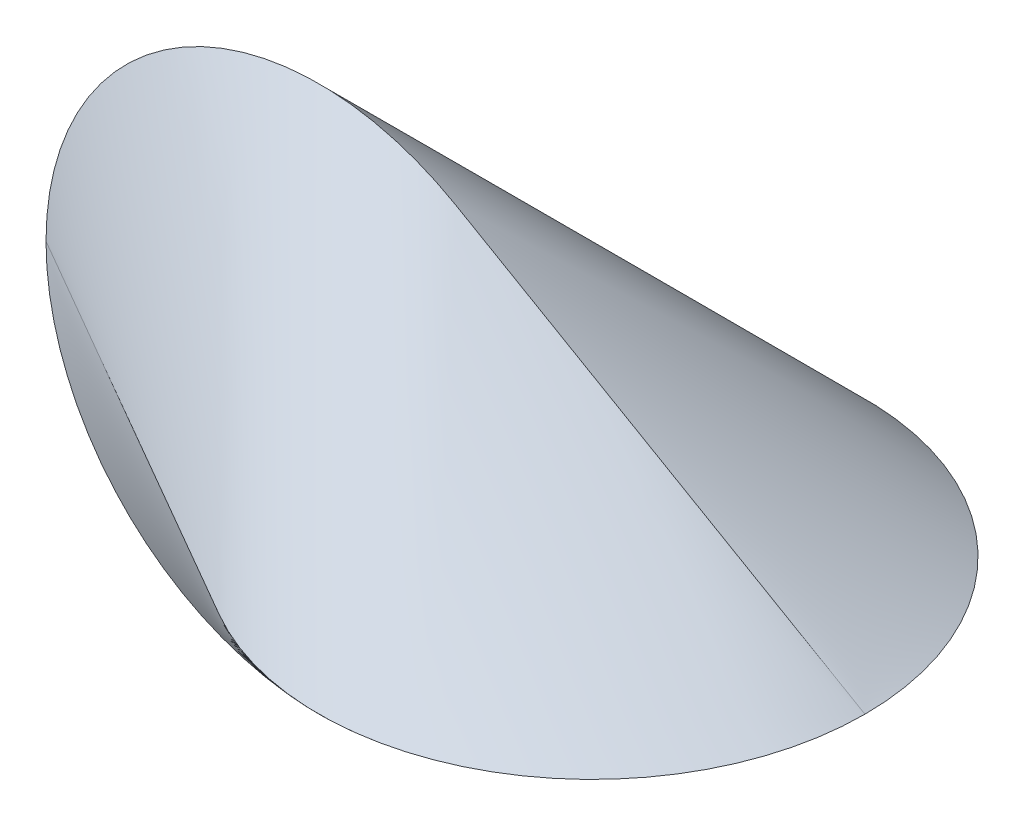
ISO-10303-21;
HEADER;
FILE_DESCRIPTION(('STEP AP214'),'2;1');
FILE_NAME('part.step','',(''),(''),'','','');
FILE_SCHEMA(('AUTOMOTIVE_DESIGN { 1 0 10303 214 1 1 1 1 }'));
ENDSEC;
DATA;
#1=APPLICATION_CONTEXT('core data for automotive mechanical design processes');
#2=APPLICATION_PROTOCOL_DEFINITION('international standard','automotive_design',2000,#1);
#3=PRODUCT_CONTEXT('',#1,'mechanical');
#4=PRODUCT('Part','Part','',(#3));
#5=PRODUCT_RELATED_PRODUCT_CATEGORY('part','',(#4));
#6=PRODUCT_DEFINITION_FORMATION('','',#4);
#7=PRODUCT_DEFINITION_CONTEXT('part definition',#1,'design');
#8=PRODUCT_DEFINITION('design','',#6,#7);
#9=PRODUCT_DEFINITION_SHAPE('','',#8);
#10=(LENGTH_UNIT() NAMED_UNIT(*) SI_UNIT(.MILLI.,.METRE.));
#11=(NAMED_UNIT(*) PLANE_ANGLE_UNIT() SI_UNIT($,.RADIAN.));
#12=(NAMED_UNIT(*) SI_UNIT($,.STERADIAN.) SOLID_ANGLE_UNIT());
#13=UNCERTAINTY_MEASURE_WITH_UNIT(LENGTH_MEASURE(1.E-05),#10,'distance_accuracy_value','');
#14=(GEOMETRIC_REPRESENTATION_CONTEXT(3) GLOBAL_UNCERTAINTY_ASSIGNED_CONTEXT((#13)) GLOBAL_UNIT_ASSIGNED_CONTEXT((#10,
#11,#12)) REPRESENTATION_CONTEXT('',''));
#15=CARTESIAN_POINT('',(0.,0.,0.));
#16=DIRECTION('',(0.,0.,1.));
#17=DIRECTION('',(1.,0.,0.));
#18=AXIS2_PLACEMENT_3D('',#15,#16,#17);
#19=CARTESIAN_POINT('',(-30.,0.,0.));
#20=CARTESIAN_POINT('',(-30.,0.,0.));
#21=CARTESIAN_POINT('',(-30.,0.,0.));
#22=CARTESIAN_POINT('',(-30.,0.,0.));
#23=CARTESIAN_POINT('',(-29.999999999999,2.02652571655713,0.));
#24=CARTESIAN_POINT('',(-29.1721405158975,1.36888850937507,0.441861216769966));
#25=CARTESIAN_POINT('',(-28.3370911941267,0.657637207182057,0.996184525936));
#26=CARTESIAN_POINT('',(-27.5092317100252,0.,1.43804574270596));
#27=CARTESIAN_POINT('',(-29.3758639581776,6.12661922809702,0.));
#28=CARTESIAN_POINT('',(-27.1481369070821,4.12004069335033,1.31693344307382));
#29=CARTESIAN_POINT('',(-24.8738394638612,2.00657853474668,2.92883553500629));
#30=CARTESIAN_POINT('',(-22.6461124127657,0.,4.24576897808011));
#31=CARTESIAN_POINT('',(-26.5968700151901,11.7186409793918,0.));
#32=CARTESIAN_POINT('',(-22.9242571474331,7.84403945583706,2.66235308980849));
#33=CARTESIAN_POINT('',(-19.1017200557311,3.87460152355479,5.750155797548));
#34=CARTESIAN_POINT('',(-15.4291071879742,0.,8.41250888735649));
#35=CARTESIAN_POINT('',(-22.3258043594985,16.1307065611163,0.));
#36=CARTESIAN_POINT('',(-17.6425701360325,10.7714781909292,4.09373168304798));
#37=CARTESIAN_POINT('',(-12.7219524219967,5.35922837018708,8.58562027677983));
#38=CARTESIAN_POINT('',(-8.03871819853068,0.,12.6793519598278));
#39=CARTESIAN_POINT('',(-18.8594471651255,18.0322155544078,0.));
#40=CARTESIAN_POINT('',(-13.58074727781,12.0316846066805,5.14770130434456));
#41=CARTESIAN_POINT('',(-8.07456166279271,6.00053094772732,10.5586152226558));
#42=CARTESIAN_POINT('',(-2.79586177547721,0.,15.7063165270003));
#43=CARTESIAN_POINT('',(-16.5347700384664,18.9110267337887,0.));
#44=CARTESIAN_POINT('',(-10.8006998133006,12.6139539091773,5.89187484329007));
#45=CARTESIAN_POINT('',(-4.89327516469523,6.29707282461142,11.914066486895));
#46=CARTESIAN_POINT('',(0.840795060470524,0.,17.805941330185));
#47=CARTESIAN_POINT('',(-15.4488115595125,19.2688613955564,0.));
#48=CARTESIAN_POINT('',(-9.46703703163746,12.8509762527413,6.19845261707458));
#49=CARTESIAN_POINT('',(-3.35111727803137,6.41788514281512,12.471956435553));
#50=CARTESIAN_POINT('',(2.63065724984368,0.,18.6704090526276));
#51=CARTESIAN_POINT('',(-14.0431163262214,19.6025487322914,0.));
#52=CARTESIAN_POINT('',(-7.75802680131317,13.0715916771179,6.44642954609055));
#53=CARTESIAN_POINT('',(-1.39620492865268,6.5309570551735,12.9255896159746));
#54=CARTESIAN_POINT('',(4.88888459625551,0.,19.3720191620651));
#55=CARTESIAN_POINT('',(-12.8704816961395,19.7997706767226,0.));
#56=CARTESIAN_POINT('',(-6.39679917756264,13.2016957708132,6.56902245409899));
#57=CARTESIAN_POINT('',(0.116354496553841,6.5980749059094,13.1515142631407));
#58=CARTESIAN_POINT('',(6.59003701513068,0.,19.7205367172397));
#59=CARTESIAN_POINT('',(-11.9606180996659,19.911038079795,0.));
#60=CARTESIAN_POINT('',(-5.37857907199369,13.2749491594257,6.62839185019588));
#61=CARTESIAN_POINT('',(1.22097215419215,6.63608892036928,13.2616542200353));
#62=CARTESIAN_POINT('',(7.80301118186434,0.,19.8900460702312));
#63=CARTESIAN_POINT('',(-11.0111121639683,19.9821773534449,0.));
#64=CARTESIAN_POINT('',(-4.36093060531631,13.3216744527373,6.66050290070785));
#65=CARTESIAN_POINT('',(2.29273451612758,6.66050290070756,13.3216744527378));
#66=CARTESIAN_POINT('',(8.94291607477959,0.,19.9821773534456));
#67=CARTESIAN_POINT('',(-10.0114929403231,20.0089113232772,0.));
#68=CARTESIAN_POINT('',(-3.33658371964466,13.3391627736311,6.66974854964606));
#69=CARTESIAN_POINT('',(3.33658371963663,6.66974854964606,13.3391627736311));
#70=CARTESIAN_POINT('',(10.0114929403151,0.,20.0089113232771));
#71=CARTESIAN_POINT('',(-8.942916074788,19.9821773534465,0.));
#72=CARTESIAN_POINT('',(-2.29273451613462,13.3216744527384,6.66050290070783));
#73=CARTESIAN_POINT('',(4.36093060531026,6.66050290070817,13.3216744527378));
#74=CARTESIAN_POINT('',(11.0111121639636,0.,19.9821773534456));
#75=CARTESIAN_POINT('',(-7.80301118186965,19.8900460702327,0.));
#76=CARTESIAN_POINT('',(-1.22097006300281,13.2616542200362,6.63609055258724));
#77=CARTESIAN_POINT('',(5.37858268405185,6.62839185019642,13.2749519787113));
#78=CARTESIAN_POINT('',(11.9606238029187,0.,19.9110425312985));
#79=CARTESIAN_POINT('',(-6.59003701513404,19.7205367172416,0.));
#80=CARTESIAN_POINT('',(-0.116358479631162,13.1515142631419,6.59807341558355));
#81=CARTESIAN_POINT('',(6.39679229770426,6.5690224540997,13.201693196614));
#82=CARTESIAN_POINT('',(12.8704708332071,0.,19.7997666121976));
#83=CARTESIAN_POINT('',(-4.88888459625611,19.3720191620674,0.));
#84=CARTESIAN_POINT('',(1.39620634696012,12.925589615976,6.53095814972875));
#85=CARTESIAN_POINT('',(7.75802925111737,6.44642954609137,13.0715935677133));
#86=CARTESIAN_POINT('',(14.0431201943336,0.,19.602551717442));
#87=CARTESIAN_POINT('',(-2.63065724984062,18.6704090526295,0.));
#88=CARTESIAN_POINT('',(3.35111573349997,12.4719564355542,6.41788467940547));
#89=CARTESIAN_POINT('',(9.46703436380828,6.19845261707526,12.8509754523064));
#90=CARTESIAN_POINT('',(15.4488073471489,0.,19.2688601317119));
#91=CARTESIAN_POINT('',(-0.840795060463497,17.8059413301851,0.));
#92=CARTESIAN_POINT('',(4.89327516470093,11.914066486895,6.29707282461188));
#93=CARTESIAN_POINT('',(10.8006998133054,5.8918748432901,12.6139539091781));
#94=CARTESIAN_POINT('',(16.5347700384698,0.,18.91102673379));
#95=CARTESIAN_POINT('',(2.79586177548442,15.7063165270001,0.));
#96=CARTESIAN_POINT('',(8.07456166279871,10.5586152226556,6.00053094772784));
#97=CARTESIAN_POINT('',(13.5807472778152,5.14770130434449,12.0316846066814));
#98=CARTESIAN_POINT('',(18.8594471651295,0.,18.0322155544092));
#99=CARTESIAN_POINT('',(8.03871819853689,12.6793519598278,0.));
#100=CARTESIAN_POINT('',(12.721952422002,8.58562027677985,5.35922837018771));
#101=CARTESIAN_POINT('',(17.6425701360372,4.09373168304798,10.7714781909303));
#102=CARTESIAN_POINT('',(22.3258043595024,0.,16.130706561118));
#103=CARTESIAN_POINT('',(15.4291071879789,8.41250888735648,0.));
#104=CARTESIAN_POINT('',(19.1017200557354,5.75015579754799,3.87460152355538));
#105=CARTESIAN_POINT('',(22.9242571474371,2.66235308980848,7.84403945583807));
#106=CARTESIAN_POINT('',(26.5968700151937,0.,11.7186409793935));
#107=CARTESIAN_POINT('',(22.6461124127683,4.24576897808012,0.));
#108=CARTESIAN_POINT('',(24.8738394638637,2.9288355350063,2.00657853474702));
#109=CARTESIAN_POINT('',(27.1481369070846,1.31693344307382,4.12004069335091));
#110=CARTESIAN_POINT('',(29.37586395818,0.,6.12661922809793));
#111=CARTESIAN_POINT('',(27.5092317100261,1.43804574270596,0.));
#112=CARTESIAN_POINT('',(28.3370911941276,0.996184525936,0.65763720718217));
#113=CARTESIAN_POINT('',(29.1721405158983,0.441861216769965,1.36888850937526));
#114=CARTESIAN_POINT('',(29.9999999999998,0.,2.02652571655743));
#115=CARTESIAN_POINT('',(29.9999999999999,0.,0.));
#116=CARTESIAN_POINT('',(29.9999999999999,0.,0.));
#117=CARTESIAN_POINT('',(29.9999999999999,0.,0.));
#118=CARTESIAN_POINT('',(29.9999999999999,0.,0.));
#119=B_SPLINE_SURFACE_WITH_KNOTS('',3,3,((#19,#20,#21,#22),(#23,#24,#25,#26),(#27,#28,#29,#30),
(#31,#32,#33,#34),(#35,#36,#37,#38),(#39,#40,#41,#42),(#43,#44,#45,#46),(#47,#48,#49,#50),(#51,
#52,#53,#54),(#55,#56,#57,#58),(#59,#60,#61,#62),(#63,#64,#65,#66),(#67,#68,#69,#70),(#71,#72,
#73,#74),(#75,#76,#77,#78),(#79,#80,#81,#82),(#83,#84,#85,#86),(#87,#88,#89,#90),(#91,#92,#93,
#94),(#95,#96,#97,#98),(#99,#100,#101,#102),(#103,#104,#105,#106),(#107,#108,#109,#110),(#111,
#112,#113,#114),(#115,#116,#117,#118)),.UNSPECIFIED.,.F.,.F.,.F.,(4,1,1,1,2,1,1,1,1,1,1,1,1,1,1,
1,2,1,1,1,4),(4,4),(0.,0.0961,0.1922,0.2883,0.3844,0.4133,0.4422,0.45665,0.4711,0.48555,0.5,
0.51445,0.5289,0.54335,0.5578,0.5867,0.6156,0.7117,0.8078,0.9039,1.),(0.,0.25),.UNSPECIFIED.);
#120=DIRECTION('',(0.866025403784439,0.,0.499999999999999));
#121=VECTOR('',#120,1.);
#122=CARTESIAN_POINT('',(-30.,0.,0.));
#123=LINE('',#122,#121);
#124=CARTESIAN_POINT('',(-30.,0.,0.));
#125=VERTEX_POINT('',#124);
#126=CARTESIAN_POINT('',(5.19652803747687E-11,0.,17.3205080757191));
#127=VERTEX_POINT('',#126);
#128=EDGE_CURVE('E13',#125,#127,#123,.T.);
#129=CARTESIAN_POINT('',(9.99999999999995,0.,0.));
#130=DIRECTION('',(0.,-1.,0.));
#131=DIRECTION('',(0.,0.,1.));
#132=AXIS2_PLACEMENT_3D('',#129,#130,#131);
#133=CIRCLE('',#132,19.9999999999999);
#134=CARTESIAN_POINT('',(29.9999999999999,0.,0.));
#135=VERTEX_POINT('',#134);
#136=EDGE_CURVE('E517',#127,#135,#133,.F.);
#137=DIRECTION('',(0.866025403784438,-0.500000000000001,0.));
#138=VECTOR('',#137,1.);
#139=CARTESIAN_POINT('',(29.9999999999999,0.,0.));
#140=LINE('',#139,#138);
#141=CARTESIAN_POINT('',(6.95043437422136E-12,17.3205080756892,0.));
#142=VERTEX_POINT('',#141);
#143=EDGE_CURVE('E525',#142,#135,#140,.T.);
#144=CARTESIAN_POINT('',(-10.,0.,0.));
#145=DIRECTION('',(0.,0.,-1.));
#146=DIRECTION('',(1.,0.,0.));
#147=AXIS2_PLACEMENT_3D('',#144,#145,#146);
#148=CIRCLE('',#147,20.);
#149=EDGE_CURVE('E545',#125,#142,#148,.T.);
#150=ORIENTED_EDGE('',*,*,#128,.T.);
#151=ORIENTED_EDGE('',*,*,#136,.T.);
#152=ORIENTED_EDGE('',*,*,#143,.F.);
#153=ORIENTED_EDGE('',*,*,#149,.F.);
#154=EDGE_LOOP('',(#150,#151,#152,#153));
#155=FACE_BOUND('',#154,.T.);
#156=ADVANCED_FACE('F504',(#155),#119,.F.);
#157=CARTESIAN_POINT('',(-30.,0.,0.));
#158=CARTESIAN_POINT('',(-30.,0.,0.));
#159=CARTESIAN_POINT('',(-30.,0.,0.));
#160=CARTESIAN_POINT('',(-30.,0.,0.));
#161=CARTESIAN_POINT('',(-27.5092317100252,0.,1.43804574270596));
#162=CARTESIAN_POINT('',(-28.3370911941267,-0.657637207182056,0.996184525936003));
#163=CARTESIAN_POINT('',(-29.1721405158975,-1.36888850937507,0.441861216769972));
#164=CARTESIAN_POINT('',(-29.999999999999,-2.02652571655713,0.));
#165=CARTESIAN_POINT('',(-22.6461124127657,0.,4.24576897808011));
#166=CARTESIAN_POINT('',(-24.8738394638611,-2.00657853474668,2.92883553500629));
#167=CARTESIAN_POINT('',(-27.1481369070821,-4.12004069335033,1.31693344307383));
#168=CARTESIAN_POINT('',(-29.3758639581776,-6.12661922809701,0.));
#169=CARTESIAN_POINT('',(-15.4291071879742,0.,8.41250888735649));
#170=CARTESIAN_POINT('',(-19.1017200557311,-3.87460152355479,5.750155797548));
#171=CARTESIAN_POINT('',(-22.9242571474331,-7.84403945583706,2.6623530898085));
#172=CARTESIAN_POINT('',(-26.5968700151901,-11.7186409793918,0.));
#173=CARTESIAN_POINT('',(-8.03871819853069,0.,12.6793519598278));
#174=CARTESIAN_POINT('',(-12.7219524219967,-5.35922837018708,8.58562027677984));
#175=CARTESIAN_POINT('',(-17.6425701360325,-10.7714781909292,4.09373168304799));
#176=CARTESIAN_POINT('',(-22.3258043594985,-16.1307065611163,0.));
#177=CARTESIAN_POINT('',(-2.79586177547721,0.,15.7063165270003));
#178=CARTESIAN_POINT('',(-8.0745616627927,-6.00053094772732,10.5586152226558));
#179=CARTESIAN_POINT('',(-13.58074727781,-12.0316846066805,5.14770130434457));
#180=CARTESIAN_POINT('',(-18.8594471651255,-18.0322155544078,0.));
#181=CARTESIAN_POINT('',(0.840795060470523,0.,17.805941330185));
#182=CARTESIAN_POINT('',(-4.89327516469522,-6.29707282461143,11.914066486895));
#183=CARTESIAN_POINT('',(-10.8006998133006,-12.6139539091773,5.89187484329008));
#184=CARTESIAN_POINT('',(-16.5347700384664,-18.9110267337887,0.));
#185=CARTESIAN_POINT('',(2.63065724984368,0.,18.6704090526276));
#186=CARTESIAN_POINT('',(-3.35111727803136,-6.41788514281511,12.471956435553));
#187=CARTESIAN_POINT('',(-9.46703703163744,-12.8509762527413,6.19845261707458));
#188=CARTESIAN_POINT('',(-15.4488115595125,-19.2688613955564,0.));
#189=CARTESIAN_POINT('',(4.88888459625551,0.,19.3720191620651));
#190=CARTESIAN_POINT('',(-1.39620492865269,-6.53095705517351,12.9255896159746));
#191=CARTESIAN_POINT('',(-7.75802680131319,-13.0715916771179,6.44642954609056));
#192=CARTESIAN_POINT('',(-14.0431163262214,-19.6025487322914,0.));
#193=CARTESIAN_POINT('',(6.59003701513067,0.,19.7205367172397));
#194=CARTESIAN_POINT('',(0.116354496553848,-6.5980749059094,13.1515142631407));
#195=CARTESIAN_POINT('',(-6.39679917756263,-13.2016957708132,6.569022454099));
#196=CARTESIAN_POINT('',(-12.8704816961395,-19.7997706767226,0.));
#197=CARTESIAN_POINT('',(7.80301118186434,0.,19.8900460702312));
#198=CARTESIAN_POINT('',(1.22097215419214,-6.63608892036929,13.2616542200353));
#199=CARTESIAN_POINT('',(-5.37857907199369,-13.2749491594257,6.62839185019588));
#200=CARTESIAN_POINT('',(-11.9606180996659,-19.911038079795,0.));
#201=CARTESIAN_POINT('',(8.94291607477959,0.,19.9821773534456));
#202=CARTESIAN_POINT('',(2.29273451612758,-6.66050290070756,13.3216744527378));
#203=CARTESIAN_POINT('',(-4.36093060531631,-13.3216744527373,6.66050290070785));
#204=CARTESIAN_POINT('',(-11.0111121639683,-19.9821773534449,0.));
#205=CARTESIAN_POINT('',(10.0114929403151,0.,20.0089113232771));
#206=CARTESIAN_POINT('',(3.33658371963663,-6.66974854964607,13.3391627736311));
#207=CARTESIAN_POINT('',(-3.33658371964465,-13.3391627736311,6.66974854964607));
#208=CARTESIAN_POINT('',(-10.0114929403231,-20.0089113232772,0.));
#209=CARTESIAN_POINT('',(11.0111121639636,0.,19.9821773534456));
#210=CARTESIAN_POINT('',(4.36093060531026,-6.66050290070817,13.3216744527378));
#211=CARTESIAN_POINT('',(-2.29273451613462,-13.3216744527384,6.66050290070783));
#212=CARTESIAN_POINT('',(-8.942916074788,-19.9821773534466,0.));
#213=CARTESIAN_POINT('',(11.9606238029187,0.,19.9110425312985));
#214=CARTESIAN_POINT('',(5.37858268405185,-6.62839185019642,13.2749519787113));
#215=CARTESIAN_POINT('',(-1.22097006300281,-13.2616542200362,6.63609055258724));
#216=CARTESIAN_POINT('',(-7.80301118186965,-19.8900460702327,0.));
#217=CARTESIAN_POINT('',(12.8704708332071,0.,19.7997666121975));
#218=CARTESIAN_POINT('',(6.39679229770426,-6.5690224540997,13.201693196614));
#219=CARTESIAN_POINT('',(-0.11635847963116,-13.1515142631419,6.59807341558355));
#220=CARTESIAN_POINT('',(-6.59003701513404,-19.7205367172416,0.));
#221=CARTESIAN_POINT('',(14.0431201943336,0.,19.602551717442));
#222=CARTESIAN_POINT('',(7.75802925111737,-6.44642954609137,13.0715935677133));
#223=CARTESIAN_POINT('',(1.39620634696012,-12.925589615976,6.53095814972875));
#224=CARTESIAN_POINT('',(-4.88888459625611,-19.3720191620674,0.));
#225=CARTESIAN_POINT('',(15.4488073471489,0.,19.2688601317119));
#226=CARTESIAN_POINT('',(9.46703436380827,-6.19845261707527,12.8509754523064));
#227=CARTESIAN_POINT('',(3.35111573349997,-12.4719564355542,6.41788467940547));
#228=CARTESIAN_POINT('',(-2.63065724984063,-18.6704090526295,0.));
#229=CARTESIAN_POINT('',(16.5347700384698,0.,18.91102673379));
#230=CARTESIAN_POINT('',(10.8006998133054,-5.8918748432901,12.6139539091781));
#231=CARTESIAN_POINT('',(4.89327516470093,-11.914066486895,6.29707282461188));
#232=CARTESIAN_POINT('',(-0.840795060463501,-17.8059413301851,0.));
#233=CARTESIAN_POINT('',(18.8594471651295,0.,18.0322155544092));
#234=CARTESIAN_POINT('',(13.5807472778152,-5.14770130434449,12.0316846066814));
#235=CARTESIAN_POINT('',(8.07456166279871,-10.5586152226556,6.00053094772784));
#236=CARTESIAN_POINT('',(2.79586177548442,-15.7063165270001,0.));
#237=CARTESIAN_POINT('',(22.3258043595024,0.,16.130706561118));
#238=CARTESIAN_POINT('',(17.6425701360372,-4.09373168304798,10.7714781909303));
#239=CARTESIAN_POINT('',(12.721952422002,-8.58562027677985,5.35922837018771));
#240=CARTESIAN_POINT('',(8.03871819853689,-12.6793519598278,0.));
#241=CARTESIAN_POINT('',(26.5968700151937,0.,11.7186409793935));
#242=CARTESIAN_POINT('',(22.9242571474371,-2.66235308980849,7.84403945583807));
#243=CARTESIAN_POINT('',(19.1017200557354,-5.750155797548,3.87460152355538));
#244=CARTESIAN_POINT('',(15.4291071879789,-8.41250888735649,0.));
#245=CARTESIAN_POINT('',(29.37586395818,0.,6.12661922809793));
#246=CARTESIAN_POINT('',(27.1481369070846,-1.31693344307382,4.12004069335091));
#247=CARTESIAN_POINT('',(24.8738394638637,-2.9288355350063,2.00657853474702));
#248=CARTESIAN_POINT('',(22.6461124127683,-4.24576897808012,0.));
#249=CARTESIAN_POINT('',(29.9999999999998,0.,2.02652571655743));
#250=CARTESIAN_POINT('',(29.1721405158983,-0.441861216769966,1.36888850937526));
#251=CARTESIAN_POINT('',(28.3370911941276,-0.996184525936,0.657637207182171));
#252=CARTESIAN_POINT('',(27.5092317100261,-1.43804574270596,0.));
#253=CARTESIAN_POINT('',(29.9999999999999,0.,0.));
#254=CARTESIAN_POINT('',(29.9999999999999,0.,0.));
#255=CARTESIAN_POINT('',(29.9999999999999,0.,0.));
#256=CARTESIAN_POINT('',(29.9999999999999,0.,0.));
#257=B_SPLINE_SURFACE_WITH_KNOTS('',3,3,((#157,#158,#159,#160),(#161,#162,#163,#164),(#165,#166,
#167,#168),(#169,#170,#171,#172),(#173,#174,#175,#176),(#177,#178,#179,#180),(#181,#182,#183,
#184),(#185,#186,#187,#188),(#189,#190,#191,#192),(#193,#194,#195,#196),(#197,#198,#199,#200),
(#201,#202,#203,#204),(#205,#206,#207,#208),(#209,#210,#211,#212),(#213,#214,#215,#216),(#217,
#218,#219,#220),(#221,#222,#223,#224),(#225,#226,#227,#228),(#229,#230,#231,#232),(#233,#234,
#235,#236),(#237,#238,#239,#240),(#241,#242,#243,#244),(#245,#246,#247,#248),(#249,#250,#251,
#252),(#253,#254,#255,#256)),.UNSPECIFIED.,.F.,.F.,.F.,(4,1,1,1,2,1,1,1,1,1,1,1,1,1,1,1,2,1,1,1,
4),(4,4),(0.,0.0961,0.1922,0.2883,0.3844,0.4133,0.4422,0.45665,0.4711,0.48555,0.5,0.51445,
0.5289,0.54335,0.5578,0.5867,0.6156,0.7117,0.8078,0.9039,1.),(0.25,0.5),.UNSPECIFIED.);
#258=CARTESIAN_POINT('',(-10.,0.,0.));
#259=DIRECTION('',(0.,0.,-1.));
#260=DIRECTION('',(-1.,0.,0.));
#261=AXIS2_PLACEMENT_3D('',#258,#259,#260);
#262=CIRCLE('',#261,20.);
#263=CARTESIAN_POINT('',(6.95895435859217E-12,-17.3205080756892,0.));
#264=VERTEX_POINT('',#263);
#265=EDGE_CURVE('E556',#125,#264,#262,.F.);
#266=DIRECTION('',(0.866025403784438,0.500000000000001,0.));
#267=VECTOR('',#266,1.);
#268=CARTESIAN_POINT('',(29.9999999999999,0.,0.));
#269=LINE('',#268,#267);
#270=EDGE_CURVE('E561',#264,#135,#269,.T.);
#271=ORIENTED_EDGE('',*,*,#265,.T.);
#272=ORIENTED_EDGE('',*,*,#270,.T.);
#273=ORIENTED_EDGE('',*,*,#136,.F.);
#274=ORIENTED_EDGE('',*,*,#128,.F.);
#275=EDGE_LOOP('',(#271,#272,#273,#274));
#276=FACE_BOUND('',#275,.T.);
#277=ADVANCED_FACE('F569',(#276),#257,.F.);
#278=CARTESIAN_POINT('',(-30.,0.,0.));
#279=CARTESIAN_POINT('',(-30.,0.,0.));
#280=CARTESIAN_POINT('',(-30.,0.,0.));
#281=CARTESIAN_POINT('',(-30.,0.,0.));
#282=CARTESIAN_POINT('',(-29.999999999999,-2.02652571655713,0.));
#283=CARTESIAN_POINT('',(-29.1721405158975,-1.36888850937507,-0.441861216769959));
#284=CARTESIAN_POINT('',(-28.3370911941267,-0.657637207182057,-0.996184525935995));
#285=CARTESIAN_POINT('',(-27.5092317100252,0.,-1.43804574270596));
#286=CARTESIAN_POINT('',(-29.3758639581776,-6.12661922809701,0.));
#287=CARTESIAN_POINT('',(-27.1481369070821,-4.12004069335032,-1.31693344307381));
#288=CARTESIAN_POINT('',(-24.8738394638612,-2.00657853474668,-2.92883553500629));
#289=CARTESIAN_POINT('',(-22.6461124127657,0.,-4.24576897808011));
#290=CARTESIAN_POINT('',(-26.5968700151901,-11.7186409793919,0.));
#291=CARTESIAN_POINT('',(-22.9242571474331,-7.84403945583706,-2.66235308980849));
#292=CARTESIAN_POINT('',(-19.1017200557311,-3.87460152355479,-5.750155797548));
#293=CARTESIAN_POINT('',(-15.4291071879742,0.,-8.41250888735649));
#294=CARTESIAN_POINT('',(-22.3258043594985,-16.1307065611163,0.));
#295=CARTESIAN_POINT('',(-17.6425701360325,-10.7714781909292,-4.09373168304797));
#296=CARTESIAN_POINT('',(-12.7219524219967,-5.35922837018708,-8.58562027677983));
#297=CARTESIAN_POINT('',(-8.03871819853068,0.,-12.6793519598278));
#298=CARTESIAN_POINT('',(-18.8594471651255,-18.0322155544079,0.));
#299=CARTESIAN_POINT('',(-13.58074727781,-12.0316846066805,-5.14770130434455));
#300=CARTESIAN_POINT('',(-8.07456166279271,-6.00053094772732,-10.5586152226557));
#301=CARTESIAN_POINT('',(-2.79586177547721,0.,-15.7063165270003));
#302=CARTESIAN_POINT('',(-16.5347700384664,-18.9110267337887,0.));
#303=CARTESIAN_POINT('',(-10.8006998133006,-12.6139539091773,-5.89187484329007));
#304=CARTESIAN_POINT('',(-4.89327516469521,-6.29707282461143,-11.914066486895));
#305=CARTESIAN_POINT('',(0.840795060470538,0.,-17.805941330185));
#306=CARTESIAN_POINT('',(-15.4488115595125,-19.2688613955564,0.));
#307=CARTESIAN_POINT('',(-9.46703703163744,-12.8509762527412,-6.19845261707457));
#308=CARTESIAN_POINT('',(-3.35111727803135,-6.41788514281512,-12.471956435553));
#309=CARTESIAN_POINT('',(2.63065724984369,0.,-18.6704090526276));
#310=CARTESIAN_POINT('',(-14.0431163262214,-19.6025487322914,0.));
#311=CARTESIAN_POINT('',(-7.75802680131318,-13.0715916771179,-6.44642954609054));
#312=CARTESIAN_POINT('',(-1.39620492865268,-6.53095705517351,-12.9255896159746));
#313=CARTESIAN_POINT('',(4.88888459625552,0.,-19.3720191620651));
#314=CARTESIAN_POINT('',(-12.8704816961395,-19.7997706767226,0.));
#315=CARTESIAN_POINT('',(-6.39679917756263,-13.2016957708132,-6.56902245409899));
#316=CARTESIAN_POINT('',(0.11635449655385,-6.59807490590941,-13.1515142631407));
#317=CARTESIAN_POINT('',(6.59003701513068,0.,-19.7205367172397));
#318=CARTESIAN_POINT('',(-11.9606180996659,-19.911038079795,0.));
#319=CARTESIAN_POINT('',(-5.37857907199369,-13.2749491594257,-6.62839185019587));
#320=CARTESIAN_POINT('',(1.22097215419214,-6.63608892036929,-13.2616542200353));
#321=CARTESIAN_POINT('',(7.80301118186434,0.,-19.8900460702312));
#322=CARTESIAN_POINT('',(-11.0111121639683,-19.9821773534448,0.));
#323=CARTESIAN_POINT('',(-4.36093060531631,-13.3216744527373,-6.66050290070785));
#324=CARTESIAN_POINT('',(2.29273451612758,-6.66050290070756,-13.3216744527378));
#325=CARTESIAN_POINT('',(8.94291607477959,0.,-19.9821773534456));
#326=CARTESIAN_POINT('',(-10.0114929403231,-20.0089113232772,0.));
#327=CARTESIAN_POINT('',(-3.33658371964465,-13.3391627736311,-6.66974854964606));
#328=CARTESIAN_POINT('',(3.33658371963662,-6.66974854964607,-13.3391627736311));
#329=CARTESIAN_POINT('',(10.011492940315,0.,-20.0089113232771));
#330=CARTESIAN_POINT('',(-8.942916074788,-19.9821773534465,0.));
#331=CARTESIAN_POINT('',(-2.29273451613461,-13.3216744527384,-6.66050290070782));
#332=CARTESIAN_POINT('',(4.36093060531027,-6.66050290070817,-13.3216744527378));
#333=CARTESIAN_POINT('',(11.0111121639637,0.,-19.9821773534456));
#334=CARTESIAN_POINT('',(-7.80301118186965,-19.8900460702327,0.));
#335=CARTESIAN_POINT('',(-1.22097006300282,-13.2616542200362,-6.63609055258723));
#336=CARTESIAN_POINT('',(5.37858268405185,-6.62839185019642,-13.2749519787113));
#337=CARTESIAN_POINT('',(11.9606238029187,0.,-19.9110425312985));
#338=CARTESIAN_POINT('',(-6.59003701513404,-19.7205367172416,0.));
#339=CARTESIAN_POINT('',(-0.116358479631162,-13.1515142631419,-6.59807341558354));
#340=CARTESIAN_POINT('',(6.39679229770426,-6.5690224540997,-13.201693196614));
#341=CARTESIAN_POINT('',(12.8704708332071,0.,-19.7997666121975));
#342=CARTESIAN_POINT('',(-4.88888459625611,-19.3720191620674,0.));
#343=CARTESIAN_POINT('',(1.39620634696012,-12.925589615976,-6.53095814972874));
#344=CARTESIAN_POINT('',(7.75802925111737,-6.44642954609137,-13.0715935677133));
#345=CARTESIAN_POINT('',(14.0431201943336,0.,-19.602551717442));
#346=CARTESIAN_POINT('',(-2.63065724984063,-18.6704090526295,0.));
#347=CARTESIAN_POINT('',(3.35111573349997,-12.4719564355542,-6.41788467940547));
#348=CARTESIAN_POINT('',(9.46703436380828,-6.19845261707527,-12.8509754523064));
#349=CARTESIAN_POINT('',(15.4488073471489,0.,-19.2688601317119));
#350=CARTESIAN_POINT('',(-0.8407950604635,-17.8059413301851,0.));
#351=CARTESIAN_POINT('',(4.89327516470093,-11.914066486895,-6.29707282461187));
#352=CARTESIAN_POINT('',(10.8006998133054,-5.89187484329011,-12.6139539091781));
#353=CARTESIAN_POINT('',(16.5347700384698,0.,-18.9110267337899));
#354=CARTESIAN_POINT('',(2.79586177548442,-15.7063165270001,0.));
#355=CARTESIAN_POINT('',(8.07456166279871,-10.5586152226556,-6.00053094772783));
#356=CARTESIAN_POINT('',(13.5807472778152,-5.14770130434449,-12.0316846066814));
#357=CARTESIAN_POINT('',(18.8594471651295,0.,-18.0322155544092));
#358=CARTESIAN_POINT('',(8.03871819853689,-12.6793519598278,0.));
#359=CARTESIAN_POINT('',(12.721952422002,-8.58562027677984,-5.3592283701877));
#360=CARTESIAN_POINT('',(17.6425701360372,-4.09373168304798,-10.7714781909303));
#361=CARTESIAN_POINT('',(22.3258043595024,0.,-16.130706561118));
#362=CARTESIAN_POINT('',(15.4291071879789,-8.41250888735648,0.));
#363=CARTESIAN_POINT('',(19.1017200557354,-5.75015579754799,-3.87460152355538));
#364=CARTESIAN_POINT('',(22.9242571474371,-2.66235308980849,-7.84403945583808));
#365=CARTESIAN_POINT('',(26.5968700151937,0.,-11.7186409793935));
#366=CARTESIAN_POINT('',(22.6461124127683,-4.24576897808012,0.));
#367=CARTESIAN_POINT('',(24.8738394638637,-2.9288355350063,-2.00657853474702));
#368=CARTESIAN_POINT('',(27.1481369070846,-1.31693344307382,-4.12004069335091));
#369=CARTESIAN_POINT('',(29.37586395818,0.,-6.12661922809792));
#370=CARTESIAN_POINT('',(27.5092317100261,-1.43804574270596,0.));
#371=CARTESIAN_POINT('',(28.3370911941276,-0.996184525936,-0.657637207182171));
#372=CARTESIAN_POINT('',(29.1721405158983,-0.441861216769965,-1.36888850937526));
#373=CARTESIAN_POINT('',(29.9999999999998,0.,-2.02652571655743));
#374=CARTESIAN_POINT('',(29.9999999999999,0.,0.));
#375=CARTESIAN_POINT('',(29.9999999999999,0.,0.));
#376=CARTESIAN_POINT('',(29.9999999999999,0.,0.));
#377=CARTESIAN_POINT('',(29.9999999999999,0.,0.));
#378=B_SPLINE_SURFACE_WITH_KNOTS('',3,3,((#278,#279,#280,#281),(#282,#283,#284,#285),(#286,#287,
#288,#289),(#290,#291,#292,#293),(#294,#295,#296,#297),(#298,#299,#300,#301),(#302,#303,#304,
#305),(#306,#307,#308,#309),(#310,#311,#312,#313),(#314,#315,#316,#317),(#318,#319,#320,#321),
(#322,#323,#324,#325),(#326,#327,#328,#329),(#330,#331,#332,#333),(#334,#335,#336,#337),(#338,
#339,#340,#341),(#342,#343,#344,#345),(#346,#347,#348,#349),(#350,#351,#352,#353),(#354,#355,
#356,#357),(#358,#359,#360,#361),(#362,#363,#364,#365),(#366,#367,#368,#369),(#370,#371,#372,
#373),(#374,#375,#376,#377)),.UNSPECIFIED.,.F.,.F.,.F.,(4,1,1,1,2,1,1,1,1,1,1,1,1,1,1,1,2,1,1,1,
4),(4,4),(0.,0.0961,0.1922,0.2883,0.3844,0.4133,0.4422,0.45665,0.4711,0.48555,0.5,0.51445,
0.5289,0.54335,0.5578,0.5867,0.6156,0.7117,0.8078,0.9039,1.),(0.5,0.75),.UNSPECIFIED.);
#379=DIRECTION('',(0.866025403784439,0.,-0.499999999999999));
#380=VECTOR('',#379,1.);
#381=CARTESIAN_POINT('',(-30.,0.,0.));
#382=LINE('',#381,#380);
#383=CARTESIAN_POINT('',(5.19680360929918E-11,0.,-17.3205080757191));
#384=VERTEX_POINT('',#383);
#385=EDGE_CURVE('E511',#125,#384,#382,.T.);
#386=CARTESIAN_POINT('',(9.99999999999995,0.,0.));
#387=DIRECTION('',(0.,1.,0.));
#388=DIRECTION('',(0.,0.,-1.));
#389=AXIS2_PLACEMENT_3D('',#386,#387,#388);
#390=CIRCLE('',#389,19.9999999999999);
#391=EDGE_CURVE('E533',#384,#135,#390,.F.);
#392=ORIENTED_EDGE('',*,*,#385,.T.);
#393=ORIENTED_EDGE('',*,*,#391,.T.);
#394=ORIENTED_EDGE('',*,*,#270,.F.);
#395=ORIENTED_EDGE('',*,*,#265,.F.);
#396=EDGE_LOOP('',(#392,#393,#394,#395));
#397=FACE_BOUND('',#396,.T.);
#398=ADVANCED_FACE('F558',(#397),#378,.F.);
#399=CARTESIAN_POINT('',(-30.,0.,0.));
#400=CARTESIAN_POINT('',(-30.,0.,0.));
#401=CARTESIAN_POINT('',(-30.,0.,0.));
#402=CARTESIAN_POINT('',(-30.,0.,0.));
#403=CARTESIAN_POINT('',(-27.5092317100252,0.,-1.43804574270596));
#404=CARTESIAN_POINT('',(-28.3370911941267,0.657637207182057,-0.996184525936));
#405=CARTESIAN_POINT('',(-29.1721405158975,1.36888850937507,-0.441861216769966));
#406=CARTESIAN_POINT('',(-29.999999999999,2.02652571655713,0.));
#407=CARTESIAN_POINT('',(-22.6461124127657,0.,-4.24576897808011));
#408=CARTESIAN_POINT('',(-24.8738394638611,2.00657853474668,-2.92883553500629));
#409=CARTESIAN_POINT('',(-27.1481369070821,4.12004069335033,-1.31693344307382));
#410=CARTESIAN_POINT('',(-29.3758639581776,6.12661922809702,0.));
#411=CARTESIAN_POINT('',(-15.4291071879742,0.,-8.41250888735649));
#412=CARTESIAN_POINT('',(-19.1017200557311,3.87460152355479,-5.750155797548));
#413=CARTESIAN_POINT('',(-22.9242571474331,7.84403945583706,-2.66235308980849));
#414=CARTESIAN_POINT('',(-26.5968700151901,11.7186409793918,0.));
#415=CARTESIAN_POINT('',(-8.03871819853067,0.,-12.6793519598278));
#416=CARTESIAN_POINT('',(-12.7219524219966,5.35922837018708,-8.58562027677983));
#417=CARTESIAN_POINT('',(-17.6425701360325,10.7714781909292,-4.09373168304798));
#418=CARTESIAN_POINT('',(-22.3258043594985,16.1307065611163,0.));
#419=CARTESIAN_POINT('',(-2.79586177547721,0.,-15.7063165270003));
#420=CARTESIAN_POINT('',(-8.07456166279271,6.00053094772732,-10.5586152226557));
#421=CARTESIAN_POINT('',(-13.58074727781,12.0316846066805,-5.14770130434456));
#422=CARTESIAN_POINT('',(-18.8594471651255,18.0322155544078,0.));
#423=CARTESIAN_POINT('',(0.840795060470539,0.,-17.805941330185));
#424=CARTESIAN_POINT('',(-4.89327516469522,6.29707282461143,-11.914066486895));
#425=CARTESIAN_POINT('',(-10.8006998133006,12.6139539091773,-5.89187484329008));
#426=CARTESIAN_POINT('',(-16.5347700384664,18.9110267337887,0.));
#427=CARTESIAN_POINT('',(2.63065724984369,0.,-18.6704090526276));
#428=CARTESIAN_POINT('',(-3.35111727803136,6.41788514281512,-12.471956435553));
#429=CARTESIAN_POINT('',(-9.46703703163745,12.8509762527413,-6.19845261707458));
#430=CARTESIAN_POINT('',(-15.4488115595125,19.2688613955564,0.));
#431=CARTESIAN_POINT('',(4.88888459625551,0.,-19.3720191620651));
#432=CARTESIAN_POINT('',(-1.39620492865268,6.5309570551735,-12.9255896159746));
#433=CARTESIAN_POINT('',(-7.75802680131318,13.0715916771179,-6.44642954609055));
#434=CARTESIAN_POINT('',(-14.0431163262214,19.6025487322914,0.));
#435=CARTESIAN_POINT('',(6.59003701513068,0.,-19.7205367172397));
#436=CARTESIAN_POINT('',(0.116354496553841,6.59807490590941,-13.1515142631407));
#437=CARTESIAN_POINT('',(-6.39679917756264,13.2016957708132,-6.56902245409899));
#438=CARTESIAN_POINT('',(-12.8704816961395,19.7997706767226,0.));
#439=CARTESIAN_POINT('',(7.80301118186434,0.,-19.8900460702312));
#440=CARTESIAN_POINT('',(1.22097215419214,6.63608892036928,-13.2616542200353));
#441=CARTESIAN_POINT('',(-5.37857907199369,13.2749491594257,-6.62839185019588));
#442=CARTESIAN_POINT('',(-11.9606180996659,19.911038079795,0.));
#443=CARTESIAN_POINT('',(8.94291607477959,0.,-19.9821773534456));
#444=CARTESIAN_POINT('',(2.29273451612758,6.66050290070756,-13.3216744527378));
#445=CARTESIAN_POINT('',(-4.3609306053163,13.3216744527373,-6.66050290070785));
#446=CARTESIAN_POINT('',(-11.0111121639683,19.9821773534448,0.));
#447=CARTESIAN_POINT('',(10.011492940315,0.,-20.0089113232771));
#448=CARTESIAN_POINT('',(3.33658371963661,6.66974854964607,-13.339162773631));
#449=CARTESIAN_POINT('',(-3.33658371964466,13.3391627736311,-6.66974854964606));
#450=CARTESIAN_POINT('',(-10.0114929403231,20.0089113232772,0.));
#451=CARTESIAN_POINT('',(11.0111121639637,0.,-19.9821773534456));
#452=CARTESIAN_POINT('',(4.36093060531027,6.66050290070818,-13.3216744527378));
#453=CARTESIAN_POINT('',(-2.29273451613461,13.3216744527384,-6.66050290070783));
#454=CARTESIAN_POINT('',(-8.942916074788,19.9821773534465,0.));
#455=CARTESIAN_POINT('',(11.9606238029187,0.,-19.9110425312985));
#456=CARTESIAN_POINT('',(5.37858268405185,6.62839185019642,-13.2749519787113));
#457=CARTESIAN_POINT('',(-1.22097006300281,13.2616542200362,-6.63609055258724));
#458=CARTESIAN_POINT('',(-7.80301118186966,19.8900460702327,0.));
#459=CARTESIAN_POINT('',(12.8704708332071,0.,-19.7997666121975));
#460=CARTESIAN_POINT('',(6.39679229770426,6.56902245409971,-13.201693196614));
#461=CARTESIAN_POINT('',(-0.116358479631156,13.1515142631419,-6.59807341558355));
#462=CARTESIAN_POINT('',(-6.59003701513403,19.7205367172416,0.));
#463=CARTESIAN_POINT('',(14.0431201943336,0.,-19.602551717442));
#464=CARTESIAN_POINT('',(7.75802925111737,6.44642954609137,-13.0715935677133));
#465=CARTESIAN_POINT('',(1.39620634696012,12.925589615976,-6.53095814972875));
#466=CARTESIAN_POINT('',(-4.88888459625611,19.3720191620674,0.));
#467=CARTESIAN_POINT('',(15.4488073471489,0.,-19.2688601317119));
#468=CARTESIAN_POINT('',(9.46703436380827,6.19845261707527,-12.8509754523064));
#469=CARTESIAN_POINT('',(3.35111573349997,12.4719564355542,-6.41788467940547));
#470=CARTESIAN_POINT('',(-2.63065724984063,18.6704090526295,0.));
#471=CARTESIAN_POINT('',(16.5347700384698,0.,-18.91102673379));
#472=CARTESIAN_POINT('',(10.8006998133054,5.8918748432901,-12.6139539091781));
#473=CARTESIAN_POINT('',(4.89327516470093,11.914066486895,-6.29707282461187));
#474=CARTESIAN_POINT('',(-0.840795060463498,17.8059413301851,0.));
#475=CARTESIAN_POINT('',(18.8594471651295,0.,-18.0322155544092));
#476=CARTESIAN_POINT('',(13.5807472778152,5.14770130434449,-12.0316846066814));
#477=CARTESIAN_POINT('',(8.07456166279871,10.5586152226556,-6.00053094772784));
#478=CARTESIAN_POINT('',(2.79586177548442,15.7063165270001,0.));
#479=CARTESIAN_POINT('',(22.3258043595024,0.,-16.130706561118));
#480=CARTESIAN_POINT('',(17.6425701360372,4.09373168304798,-10.7714781909303));
#481=CARTESIAN_POINT('',(12.721952422002,8.58562027677985,-5.35922837018771));
#482=CARTESIAN_POINT('',(8.03871819853689,12.6793519598278,0.));
#483=CARTESIAN_POINT('',(26.5968700151937,0.,-11.7186409793935));
#484=CARTESIAN_POINT('',(22.9242571474371,2.66235308980849,-7.84403945583808));
#485=CARTESIAN_POINT('',(19.1017200557354,5.75015579754799,-3.87460152355538));
#486=CARTESIAN_POINT('',(15.4291071879789,8.41250888735648,0.));
#487=CARTESIAN_POINT('',(29.37586395818,0.,-6.12661922809793));
#488=CARTESIAN_POINT('',(27.1481369070846,1.31693344307382,-4.12004069335091));
#489=CARTESIAN_POINT('',(24.8738394638637,2.9288355350063,-2.00657853474702));
#490=CARTESIAN_POINT('',(22.6461124127683,4.24576897808012,0.));
#491=CARTESIAN_POINT('',(29.9999999999998,0.,-2.02652571655743));
#492=CARTESIAN_POINT('',(29.1721405158983,0.441861216769967,-1.36888850937526));
#493=CARTESIAN_POINT('',(28.3370911941276,0.996184525936001,-0.65763720718217));
#494=CARTESIAN_POINT('',(27.5092317100261,1.43804574270596,0.));
#495=CARTESIAN_POINT('',(29.9999999999999,0.,0.));
#496=CARTESIAN_POINT('',(29.9999999999999,0.,0.));
#497=CARTESIAN_POINT('',(29.9999999999999,0.,0.));
#498=CARTESIAN_POINT('',(29.9999999999999,0.,0.));
#499=B_SPLINE_SURFACE_WITH_KNOTS('',3,3,((#399,#400,#401,#402),(#403,#404,#405,#406),(#407,#408,
#409,#410),(#411,#412,#413,#414),(#415,#416,#417,#418),(#419,#420,#421,#422),(#423,#424,#425,
#426),(#427,#428,#429,#430),(#431,#432,#433,#434),(#435,#436,#437,#438),(#439,#440,#441,#442),
(#443,#444,#445,#446),(#447,#448,#449,#450),(#451,#452,#453,#454),(#455,#456,#457,#458),(#459,
#460,#461,#462),(#463,#464,#465,#466),(#467,#468,#469,#470),(#471,#472,#473,#474),(#475,#476,
#477,#478),(#479,#480,#481,#482),(#483,#484,#485,#486),(#487,#488,#489,#490),(#491,#492,#493,
#494),(#495,#496,#497,#498)),.UNSPECIFIED.,.F.,.F.,.F.,(4,1,1,1,2,1,1,1,1,1,1,1,1,1,1,1,2,1,1,1,
4),(4,4),(0.,0.0961,0.1922,0.2883,0.3844,0.4133,0.4422,0.45665,0.4711,0.48555,0.5,0.51445,
0.5289,0.54335,0.5578,0.5867,0.6156,0.7117,0.8078,0.9039,1.),(0.75,1.),.UNSPECIFIED.);
#500=ORIENTED_EDGE('',*,*,#149,.T.);
#501=ORIENTED_EDGE('',*,*,#143,.T.);
#502=ORIENTED_EDGE('',*,*,#391,.F.);
#503=ORIENTED_EDGE('',*,*,#385,.F.);
#504=EDGE_LOOP('',(#500,#501,#502,#503));
#505=FACE_BOUND('',#504,.T.);
#506=ADVANCED_FACE('F506',(#505),#499,.F.);
#507=CLOSED_SHELL('',(#156,#277,#398,#506));
#508=MANIFOLD_SOLID_BREP('B2',#507);
#509=ADVANCED_BREP_SHAPE_REPRESENTATION('',(#18,#508),#14);
#510=SHAPE_DEFINITION_REPRESENTATION(#9,#509);
ENDSEC;
END-ISO-10303-21;
